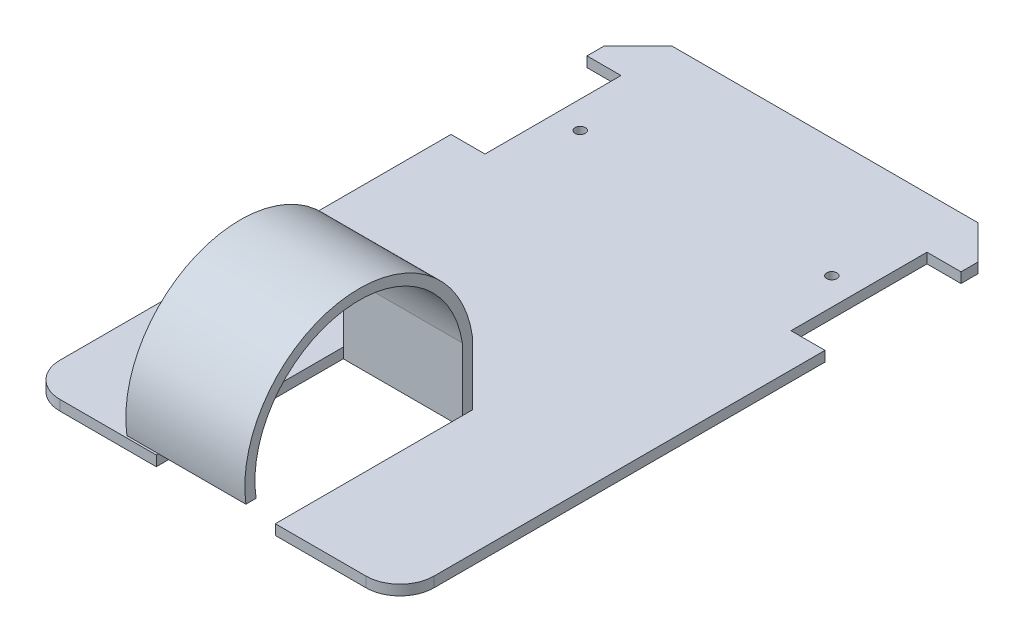
ISO-10303-21;
HEADER;
FILE_DESCRIPTION(('STEP AP214'),'2;1');
FILE_NAME('part.step','',(''),(''),'','','');
FILE_SCHEMA(('AUTOMOTIVE_DESIGN { 1 0 10303 214 1 1 1 1 }'));
ENDSEC;
DATA;
#1=APPLICATION_CONTEXT('core data for automotive mechanical design processes');
#2=APPLICATION_PROTOCOL_DEFINITION('international standard','automotive_design',2000,#1);
#3=PRODUCT_CONTEXT('',#1,'mechanical');
#4=PRODUCT('Part','Part','',(#3));
#5=PRODUCT_RELATED_PRODUCT_CATEGORY('part','',(#4));
#6=PRODUCT_DEFINITION_FORMATION('','',#4);
#7=PRODUCT_DEFINITION_CONTEXT('part definition',#1,'design');
#8=PRODUCT_DEFINITION('design','',#6,#7);
#9=PRODUCT_DEFINITION_SHAPE('','',#8);
#10=(LENGTH_UNIT() NAMED_UNIT(*) SI_UNIT(.MILLI.,.METRE.));
#11=(NAMED_UNIT(*) PLANE_ANGLE_UNIT() SI_UNIT($,.RADIAN.));
#12=(NAMED_UNIT(*) SI_UNIT($,.STERADIAN.) SOLID_ANGLE_UNIT());
#13=UNCERTAINTY_MEASURE_WITH_UNIT(LENGTH_MEASURE(1.E-05),#10,'distance_accuracy_value','');
#14=(GEOMETRIC_REPRESENTATION_CONTEXT(3) GLOBAL_UNCERTAINTY_ASSIGNED_CONTEXT((#13)) GLOBAL_UNIT_ASSIGNED_CONTEXT((#10,
#11,#12)) REPRESENTATION_CONTEXT('',''));
#15=CARTESIAN_POINT('',(0.,0.,0.));
#16=DIRECTION('',(0.,0.,1.));
#17=DIRECTION('',(1.,0.,0.));
#18=AXIS2_PLACEMENT_3D('',#15,#16,#17);
#19=CARTESIAN_POINT('',(55.,3.,90.));
#20=DIRECTION('',(-1.,0.,0.));
#21=DIRECTION('',(0.,0.,1.));
#22=AXIS2_PLACEMENT_3D('',#19,#20,#21);
#23=PLANE('',#22);
#24=DIRECTION('',(0.,0.,-1.));
#25=VECTOR('',#24,1.);
#26=CARTESIAN_POINT('',(55.,0.,90.));
#27=LINE('',#26,#25);
#28=CARTESIAN_POINT('',(55.,0.,80.));
#29=VERTEX_POINT('',#28);
#30=CARTESIAN_POINT('',(55.,0.,-35.));
#31=VERTEX_POINT('',#30);
#32=EDGE_CURVE('E222',#29,#31,#27,.T.);
#33=ORIENTED_EDGE('',*,*,#32,.T.);
#34=DIRECTION('',(0.,1.,0.));
#35=VECTOR('',#34,1.);
#36=CARTESIAN_POINT('',(55.,-0.00100000000000013,-35.));
#37=LINE('',#36,#35);
#38=CARTESIAN_POINT('',(55.,3.,-35.));
#39=VERTEX_POINT('',#38);
#40=EDGE_CURVE('E202',#31,#39,#37,.T.);
#41=ORIENTED_EDGE('',*,*,#40,.T.);
#42=DIRECTION('',(0.,0.,-1.));
#43=VECTOR('',#42,1.);
#44=CARTESIAN_POINT('',(55.,3.,90.));
#45=LINE('',#44,#43);
#46=CARTESIAN_POINT('',(55.,3.,80.));
#47=VERTEX_POINT('',#46);
#48=EDGE_CURVE('E452',#47,#39,#45,.T.);
#49=ORIENTED_EDGE('',*,*,#48,.F.);
#50=DIRECTION('',(0.,-1.,0.));
#51=VECTOR('',#50,1.);
#52=CARTESIAN_POINT('',(55.,3.,80.));
#53=LINE('',#52,#51);
#54=EDGE_CURVE('E230',#47,#29,#53,.T.);
#55=ORIENTED_EDGE('',*,*,#54,.T.);
#56=EDGE_LOOP('',(#33,#41,#49,#55));
#57=FACE_BOUND('',#56,.T.);
#58=ADVANCED_FACE('F34',(#57),#23,.F.);
#59=CARTESIAN_POINT('',(-55.,3.,90.));
#60=DIRECTION('',(1.,0.,0.));
#61=DIRECTION('',(0.,0.,-1.));
#62=AXIS2_PLACEMENT_3D('',#59,#60,#61);
#63=PLANE('',#62);
#64=DIRECTION('',(0.,0.,1.));
#65=VECTOR('',#64,1.);
#66=CARTESIAN_POINT('',(-55.,3.,90.));
#67=LINE('',#66,#65);
#68=CARTESIAN_POINT('',(-55.,3.,-79.9999999999999));
#69=VERTEX_POINT('',#68);
#70=CARTESIAN_POINT('',(-55.,3.,-75.));
#71=VERTEX_POINT('',#70);
#72=EDGE_CURVE('E314',#69,#71,#67,.T.);
#73=ORIENTED_EDGE('',*,*,#72,.F.);
#74=DIRECTION('',(0.,-1.,0.));
#75=VECTOR('',#74,1.);
#76=CARTESIAN_POINT('',(-55.,3.,-80.));
#77=LINE('',#76,#75);
#78=CARTESIAN_POINT('',(-55.,0.,-79.9999999999999));
#79=VERTEX_POINT('',#78);
#80=EDGE_CURVE('E265',#69,#79,#77,.T.);
#81=ORIENTED_EDGE('',*,*,#80,.T.);
#82=DIRECTION('',(0.,0.,1.));
#83=VECTOR('',#82,1.);
#84=CARTESIAN_POINT('',(-55.,0.,90.));
#85=LINE('',#84,#83);
#86=CARTESIAN_POINT('',(-55.,0.,-74.9999999999999));
#87=VERTEX_POINT('',#86);
#88=EDGE_CURVE('E241',#79,#87,#85,.T.);
#89=ORIENTED_EDGE('',*,*,#88,.T.);
#90=DIRECTION('',(0.,1.,0.));
#91=VECTOR('',#90,1.);
#92=CARTESIAN_POINT('',(-55.,-0.00100000000000013,-75.));
#93=LINE('',#92,#91);
#94=EDGE_CURVE('E323',#87,#71,#93,.T.);
#95=ORIENTED_EDGE('',*,*,#94,.T.);
#96=EDGE_LOOP('',(#73,#81,#89,#95));
#97=FACE_BOUND('',#96,.T.);
#98=ADVANCED_FACE('F321',(#97),#63,.F.);
#99=CARTESIAN_POINT('',(0.,3.,0.));
#100=DIRECTION('',(0.,-1.,0.));
#101=DIRECTION('',(0.,0.,-1.));
#102=AXIS2_PLACEMENT_3D('',#99,#100,#101);
#103=PLANE('',#102);
#104=CARTESIAN_POINT('',(-37.,3.,-55.));
#105=DIRECTION('',(0.,1.,0.));
#106=DIRECTION('',(0.,0.,1.));
#107=AXIS2_PLACEMENT_3D('',#104,#105,#106);
#108=CIRCLE('',#107,1.5);
#109=CARTESIAN_POINT('',(-37.,3.,-53.5));
#110=VERTEX_POINT('',#109);
#111=EDGE_CURVE('E424',#110,#110,#108,.T.);
#112=ORIENTED_EDGE('',*,*,#111,.F.);
#113=EDGE_LOOP('',(#112));
#114=FACE_BOUND('',#113,.T.);
#115=CARTESIAN_POINT('',(37.,3.,-55.));
#116=DIRECTION('',(0.,1.,0.));
#117=DIRECTION('',(0.,0.,1.));
#118=AXIS2_PLACEMENT_3D('',#115,#116,#117);
#119=CIRCLE('',#118,1.5);
#120=CARTESIAN_POINT('',(37.,3.,-53.5));
#121=VERTEX_POINT('',#120);
#122=EDGE_CURVE('E417',#121,#121,#119,.T.);
#123=ORIENTED_EDGE('',*,*,#122,.F.);
#124=EDGE_LOOP('',(#123));
#125=FACE_BOUND('',#124,.T.);
#126=DIRECTION('',(-1.,0.,0.));
#127=VECTOR('',#126,1.);
#128=CARTESIAN_POINT('',(-55.,3.,-90.));
#129=LINE('',#128,#127);
#130=CARTESIAN_POINT('',(45.,3.,-90.));
#131=VERTEX_POINT('',#130);
#132=CARTESIAN_POINT('',(-45.,3.,-90.));
#133=VERTEX_POINT('',#132);
#134=EDGE_CURVE('E316',#131,#133,#129,.T.);
#135=ORIENTED_EDGE('',*,*,#134,.T.);
#136=DIRECTION('',(0.70710678118655,0.,-0.707106781186546));
#137=VECTOR('',#136,1.);
#138=CARTESIAN_POINT('',(-55.,3.,-80.));
#139=LINE('',#138,#137);
#140=EDGE_CURVE('E42',#133,#69,#139,.F.);
#141=ORIENTED_EDGE('',*,*,#140,.T.);
#142=ORIENTED_EDGE('',*,*,#72,.T.);
#143=DIRECTION('',(-1.,0.,0.));
#144=VECTOR('',#143,1.);
#145=CARTESIAN_POINT('',(-55.,3.,-75.));
#146=LINE('',#145,#144);
#147=CARTESIAN_POINT('',(-45.,3.,-75.));
#148=VERTEX_POINT('',#147);
#149=EDGE_CURVE('E360',#148,#71,#146,.T.);
#150=ORIENTED_EDGE('',*,*,#149,.F.);
#151=DIRECTION('',(0.,0.,-1.));
#152=VECTOR('',#151,1.);
#153=CARTESIAN_POINT('',(-45.,3.,-75.));
#154=LINE('',#153,#152);
#155=CARTESIAN_POINT('',(-45.,3.,-35.));
#156=VERTEX_POINT('',#155);
#157=EDGE_CURVE('E357',#156,#148,#154,.T.);
#158=ORIENTED_EDGE('',*,*,#157,.F.);
#159=DIRECTION('',(1.,0.,0.));
#160=VECTOR('',#159,1.);
#161=CARTESIAN_POINT('',(-45.,3.,-35.));
#162=LINE('',#161,#160);
#163=CARTESIAN_POINT('',(-55.,3.,-35.));
#164=VERTEX_POINT('',#163);
#165=EDGE_CURVE('E354',#164,#156,#162,.T.);
#166=ORIENTED_EDGE('',*,*,#165,.F.);
#167=CARTESIAN_POINT('',(-55.,3.,80.));
#168=VERTEX_POINT('',#167);
#169=EDGE_CURVE('E325',#164,#168,#67,.T.);
#170=ORIENTED_EDGE('',*,*,#169,.T.);
#171=CARTESIAN_POINT('',(-45.,3.,80.));
#172=DIRECTION('',(0.,-1.,0.));
#173=DIRECTION('',(0.,0.,-1.));
#174=AXIS2_PLACEMENT_3D('',#171,#172,#173);
#175=CIRCLE('',#174,10.);
#176=CARTESIAN_POINT('',(-45.,3.,90.));
#177=VERTEX_POINT('',#176);
#178=EDGE_CURVE('E256',#168,#177,#175,.F.);
#179=ORIENTED_EDGE('',*,*,#178,.T.);
#180=DIRECTION('',(1.,0.,0.));
#181=VECTOR('',#180,1.);
#182=CARTESIAN_POINT('',(-55.,3.,90.));
#183=LINE('',#182,#181);
#184=CARTESIAN_POINT('',(-16.6764380170673,3.,90.));
#185=VERTEX_POINT('',#184);
#186=EDGE_CURVE('E238',#177,#185,#183,.T.);
#187=ORIENTED_EDGE('',*,*,#186,.T.);
#188=DIRECTION('',(0.,0.,1.));
#189=VECTOR('',#188,1.);
#190=CARTESIAN_POINT('',(-16.6764380170673,3.,35.));
#191=LINE('',#190,#189);
#192=CARTESIAN_POINT('',(-16.6764380170673,3.,35.));
#193=VERTEX_POINT('',#192);
#194=EDGE_CURVE('E437',#193,#185,#191,.T.);
#195=ORIENTED_EDGE('',*,*,#194,.F.);
#196=DIRECTION('',(0.,0.,1.));
#197=VECTOR('',#196,1.);
#198=CARTESIAN_POINT('',(-16.6764380170673,3.,35.));
#199=LINE('',#198,#197);
#200=CARTESIAN_POINT('',(-16.6764380170673,3.,32.));
#201=VERTEX_POINT('',#200);
#202=EDGE_CURVE('E285',#201,#193,#199,.T.);
#203=ORIENTED_EDGE('',*,*,#202,.F.);
#204=DIRECTION('',(-1.,0.,0.));
#205=VECTOR('',#204,1.);
#206=CARTESIAN_POINT('',(18.3235619829327,3.,32.));
#207=LINE('',#206,#205);
#208=CARTESIAN_POINT('',(18.3235619829327,3.,32.));
#209=VERTEX_POINT('',#208);
#210=EDGE_CURVE('E412',#209,#201,#207,.T.);
#211=ORIENTED_EDGE('',*,*,#210,.F.);
#212=DIRECTION('',(0.,0.,-1.));
#213=VECTOR('',#212,1.);
#214=CARTESIAN_POINT('',(18.3235619829327,3.,35.));
#215=LINE('',#214,#213);
#216=CARTESIAN_POINT('',(18.3235619829327,3.,35.));
#217=VERTEX_POINT('',#216);
#218=EDGE_CURVE('E375',#217,#209,#215,.T.);
#219=ORIENTED_EDGE('',*,*,#218,.F.);
#220=DIRECTION('',(0.,0.,-1.));
#221=VECTOR('',#220,1.);
#222=CARTESIAN_POINT('',(18.3235619829327,3.,35.));
#223=LINE('',#222,#221);
#224=CARTESIAN_POINT('',(18.3235619829327,3.,90.));
#225=VERTEX_POINT('',#224);
#226=EDGE_CURVE('E440',#225,#217,#223,.T.);
#227=ORIENTED_EDGE('',*,*,#226,.F.);
#228=CARTESIAN_POINT('',(45.,3.,90.));
#229=VERTEX_POINT('',#228);
#230=EDGE_CURVE('E324',#225,#229,#183,.T.);
#231=ORIENTED_EDGE('',*,*,#230,.T.);
#232=CARTESIAN_POINT('',(45.,3.,80.));
#233=DIRECTION('',(0.,-1.,0.));
#234=DIRECTION('',(0.,0.,-1.));
#235=AXIS2_PLACEMENT_3D('',#232,#233,#234);
#236=CIRCLE('',#235,10.);
#237=EDGE_CURVE('E263',#229,#47,#236,.F.);
#238=ORIENTED_EDGE('',*,*,#237,.T.);
#239=ORIENTED_EDGE('',*,*,#48,.T.);
#240=DIRECTION('',(1.,0.,0.));
#241=VECTOR('',#240,1.);
#242=CARTESIAN_POINT('',(45.,3.,-35.));
#243=LINE('',#242,#241);
#244=CARTESIAN_POINT('',(45.,3.,-35.));
#245=VERTEX_POINT('',#244);
#246=EDGE_CURVE('E208',#245,#39,#243,.T.);
#247=ORIENTED_EDGE('',*,*,#246,.F.);
#248=DIRECTION('',(0.,0.,1.));
#249=VECTOR('',#248,1.);
#250=CARTESIAN_POINT('',(45.,3.,-75.));
#251=LINE('',#250,#249);
#252=CARTESIAN_POINT('',(45.,3.,-75.));
#253=VERTEX_POINT('',#252);
#254=EDGE_CURVE('E343',#253,#245,#251,.T.);
#255=ORIENTED_EDGE('',*,*,#254,.F.);
#256=DIRECTION('',(-1.,0.,0.));
#257=VECTOR('',#256,1.);
#258=CARTESIAN_POINT('',(55.,3.,-75.));
#259=LINE('',#258,#257);
#260=CARTESIAN_POINT('',(55.,3.,-75.));
#261=VERTEX_POINT('',#260);
#262=EDGE_CURVE('E226',#261,#253,#259,.T.);
#263=ORIENTED_EDGE('',*,*,#262,.F.);
#264=CARTESIAN_POINT('',(55.,3.,-79.9999999999999));
#265=VERTEX_POINT('',#264);
#266=EDGE_CURVE('E246',#261,#265,#45,.T.);
#267=ORIENTED_EDGE('',*,*,#266,.T.);
#268=DIRECTION('',(0.707106781186547,0.,0.707106781186549));
#269=VECTOR('',#268,1.);
#270=CARTESIAN_POINT('',(45.,3.,-90.));
#271=LINE('',#270,#269);
#272=EDGE_CURVE('E308',#265,#131,#271,.F.);
#273=ORIENTED_EDGE('',*,*,#272,.T.);
#274=EDGE_LOOP('',(#135,#141,#142,#150,#158,#166,#170,#179,#187,#195,#203,#211,#219,#227,#231,
#238,#239,#247,#255,#263,#267,#273));
#275=FACE_BOUND('',#274,.T.);
#276=ADVANCED_FACE('F312',(#114,#125,#275),#103,.F.);
#277=CARTESIAN_POINT('',(-55.,3.,90.));
#278=DIRECTION('',(0.,0.,-1.));
#279=DIRECTION('',(-1.,0.,0.));
#280=AXIS2_PLACEMENT_3D('',#277,#278,#279);
#281=PLANE('',#280);
#282=ORIENTED_EDGE('',*,*,#186,.F.);
#283=DIRECTION('',(0.,-1.,0.));
#284=VECTOR('',#283,1.);
#285=CARTESIAN_POINT('',(-45.,3.,90.));
#286=LINE('',#285,#284);
#287=CARTESIAN_POINT('',(-45.,0.,90.));
#288=VERTEX_POINT('',#287);
#289=EDGE_CURVE('E247',#177,#288,#286,.T.);
#290=ORIENTED_EDGE('',*,*,#289,.T.);
#291=DIRECTION('',(1.,0.,0.));
#292=VECTOR('',#291,1.);
#293=CARTESIAN_POINT('',(-55.,0.,90.));
#294=LINE('',#293,#292);
#295=CARTESIAN_POINT('',(-16.6764380170673,0.,90.));
#296=VERTEX_POINT('',#295);
#297=EDGE_CURVE('E244',#288,#296,#294,.T.);
#298=ORIENTED_EDGE('',*,*,#297,.T.);
#299=DIRECTION('',(0.,1.,0.));
#300=VECTOR('',#299,1.);
#301=CARTESIAN_POINT('',(-16.6764380170673,-0.00100000000000013,90.));
#302=LINE('',#301,#300);
#303=EDGE_CURVE('E443',#296,#185,#302,.T.);
#304=ORIENTED_EDGE('',*,*,#303,.T.);
#305=EDGE_LOOP('',(#282,#290,#298,#304));
#306=FACE_BOUND('',#305,.T.);
#307=ADVANCED_FACE('F469',(#306),#281,.F.);
#308=CARTESIAN_POINT('',(55.,0.,-74.9999999999999));
#309=VERTEX_POINT('',#308);
#310=CARTESIAN_POINT('',(55.,0.,-79.9999999999999));
#311=VERTEX_POINT('',#310);
#312=EDGE_CURVE('E232',#309,#311,#27,.T.);
#313=ORIENTED_EDGE('',*,*,#312,.T.);
#314=DIRECTION('',(0.,1.,0.));
#315=VECTOR('',#314,1.);
#316=CARTESIAN_POINT('',(55.,3.,-80.));
#317=LINE('',#316,#315);
#318=EDGE_CURVE('E12',#311,#265,#317,.T.);
#319=ORIENTED_EDGE('',*,*,#318,.T.);
#320=ORIENTED_EDGE('',*,*,#266,.F.);
#321=DIRECTION('',(0.,1.,0.));
#322=VECTOR('',#321,1.);
#323=CARTESIAN_POINT('',(55.,-0.00100000000000013,-75.));
#324=LINE('',#323,#322);
#325=EDGE_CURVE('E336',#309,#261,#324,.T.);
#326=ORIENTED_EDGE('',*,*,#325,.F.);
#327=EDGE_LOOP('',(#313,#319,#320,#326));
#328=FACE_BOUND('',#327,.T.);
#329=ADVANCED_FACE('F335',(#328),#23,.F.);
#330=CARTESIAN_POINT('',(-55.,3.,-90.));
#331=DIRECTION('',(0.,0.,1.));
#332=DIRECTION('',(1.,0.,0.));
#333=AXIS2_PLACEMENT_3D('',#330,#331,#332);
#334=PLANE('',#333);
#335=DIRECTION('',(-1.,0.,0.));
#336=VECTOR('',#335,1.);
#337=CARTESIAN_POINT('',(-55.,0.,-90.));
#338=LINE('',#337,#336);
#339=CARTESIAN_POINT('',(45.,0.,-90.));
#340=VERTEX_POINT('',#339);
#341=CARTESIAN_POINT('',(-45.,0.,-90.));
#342=VERTEX_POINT('',#341);
#343=EDGE_CURVE('E231',#340,#342,#338,.T.);
#344=ORIENTED_EDGE('',*,*,#343,.T.);
#345=DIRECTION('',(0.,1.,0.));
#346=VECTOR('',#345,1.);
#347=CARTESIAN_POINT('',(-45.,3.,-90.));
#348=LINE('',#347,#346);
#349=EDGE_CURVE('E55',#342,#133,#348,.T.);
#350=ORIENTED_EDGE('',*,*,#349,.T.);
#351=ORIENTED_EDGE('',*,*,#134,.F.);
#352=DIRECTION('',(0.,-1.,0.));
#353=VECTOR('',#352,1.);
#354=CARTESIAN_POINT('',(45.,3.,-90.));
#355=LINE('',#354,#353);
#356=EDGE_CURVE('E304',#131,#340,#355,.T.);
#357=ORIENTED_EDGE('',*,*,#356,.T.);
#358=EDGE_LOOP('',(#344,#350,#351,#357));
#359=FACE_BOUND('',#358,.T.);
#360=ADVANCED_FACE('F329',(#359),#334,.F.);
#361=ORIENTED_EDGE('',*,*,#169,.F.);
#362=DIRECTION('',(0.,1.,0.));
#363=VECTOR('',#362,1.);
#364=CARTESIAN_POINT('',(-55.,-0.00100000000000013,-35.));
#365=LINE('',#364,#363);
#366=CARTESIAN_POINT('',(-55.,0.,-35.));
#367=VERTEX_POINT('',#366);
#368=EDGE_CURVE('E362',#367,#164,#365,.T.);
#369=ORIENTED_EDGE('',*,*,#368,.F.);
#370=CARTESIAN_POINT('',(-55.,0.,80.));
#371=VERTEX_POINT('',#370);
#372=EDGE_CURVE('E234',#367,#371,#85,.T.);
#373=ORIENTED_EDGE('',*,*,#372,.T.);
#374=DIRECTION('',(0.,-1.,0.));
#375=VECTOR('',#374,1.);
#376=CARTESIAN_POINT('',(-55.,3.,80.));
#377=LINE('',#376,#375);
#378=EDGE_CURVE('E253',#371,#168,#377,.F.);
#379=ORIENTED_EDGE('',*,*,#378,.T.);
#380=EDGE_LOOP('',(#361,#369,#373,#379));
#381=FACE_BOUND('',#380,.T.);
#382=ADVANCED_FACE('F462',(#381),#63,.F.);
#383=CARTESIAN_POINT('',(18.3235619829327,0.,90.));
#384=VERTEX_POINT('',#383);
#385=CARTESIAN_POINT('',(45.,0.,90.));
#386=VERTEX_POINT('',#385);
#387=EDGE_CURVE('E243',#384,#386,#294,.T.);
#388=ORIENTED_EDGE('',*,*,#387,.T.);
#389=DIRECTION('',(0.,-1.,0.));
#390=VECTOR('',#389,1.);
#391=CARTESIAN_POINT('',(45.,3.,90.));
#392=LINE('',#391,#390);
#393=EDGE_CURVE('E261',#386,#229,#392,.F.);
#394=ORIENTED_EDGE('',*,*,#393,.T.);
#395=ORIENTED_EDGE('',*,*,#230,.F.);
#396=DIRECTION('',(0.,1.,0.));
#397=VECTOR('',#396,1.);
#398=CARTESIAN_POINT('',(18.3235619829327,-0.00100000000000013,90.));
#399=LINE('',#398,#397);
#400=EDGE_CURVE('E448',#384,#225,#399,.T.);
#401=ORIENTED_EDGE('',*,*,#400,.F.);
#402=EDGE_LOOP('',(#388,#394,#395,#401));
#403=FACE_BOUND('',#402,.T.);
#404=ADVANCED_FACE('F497',(#403),#281,.F.);
#405=CARTESIAN_POINT('',(0.,0.,0.));
#406=DIRECTION('',(0.,-1.,0.));
#407=DIRECTION('',(0.,0.,-1.));
#408=AXIS2_PLACEMENT_3D('',#405,#406,#407);
#409=PLANE('',#408);
#410=ORIENTED_EDGE('',*,*,#88,.F.);
#411=DIRECTION('',(-0.70710678118655,0.,0.707106781186546));
#412=VECTOR('',#411,1.);
#413=CARTESIAN_POINT('',(-67.4999999999999,0.,-67.5000000000002));
#414=LINE('',#413,#412);
#415=EDGE_CURVE('E302',#79,#342,#414,.F.);
#416=ORIENTED_EDGE('',*,*,#415,.T.);
#417=ORIENTED_EDGE('',*,*,#343,.F.);
#418=DIRECTION('',(-0.707106781186547,0.,-0.707106781186549));
#419=VECTOR('',#418,1.);
#420=CARTESIAN_POINT('',(67.5000000000001,0.,-67.4999999999999));
#421=LINE('',#420,#419);
#422=EDGE_CURVE('E300',#340,#311,#421,.F.);
#423=ORIENTED_EDGE('',*,*,#422,.T.);
#424=ORIENTED_EDGE('',*,*,#312,.F.);
#425=DIRECTION('',(-1.,0.,0.));
#426=VECTOR('',#425,1.);
#427=CARTESIAN_POINT('',(55.,0.,-75.));
#428=LINE('',#427,#426);
#429=CARTESIAN_POINT('',(45.,0.,-75.));
#430=VERTEX_POINT('',#429);
#431=EDGE_CURVE('E213',#309,#430,#428,.T.);
#432=ORIENTED_EDGE('',*,*,#431,.T.);
#433=DIRECTION('',(0.,0.,1.));
#434=VECTOR('',#433,1.);
#435=CARTESIAN_POINT('',(45.,0.,-75.));
#436=LINE('',#435,#434);
#437=CARTESIAN_POINT('',(45.,0.,-35.));
#438=VERTEX_POINT('',#437);
#439=EDGE_CURVE('E225',#430,#438,#436,.T.);
#440=ORIENTED_EDGE('',*,*,#439,.T.);
#441=DIRECTION('',(1.,0.,0.));
#442=VECTOR('',#441,1.);
#443=CARTESIAN_POINT('',(45.,0.,-35.));
#444=LINE('',#443,#442);
#445=EDGE_CURVE('E205',#438,#31,#444,.T.);
#446=ORIENTED_EDGE('',*,*,#445,.T.);
#447=ORIENTED_EDGE('',*,*,#32,.F.);
#448=CARTESIAN_POINT('',(45.,0.,80.));
#449=DIRECTION('',(0.,-1.,0.));
#450=DIRECTION('',(0.,0.,-1.));
#451=AXIS2_PLACEMENT_3D('',#448,#449,#450);
#452=CIRCLE('',#451,10.);
#453=EDGE_CURVE('E259',#29,#386,#452,.T.);
#454=ORIENTED_EDGE('',*,*,#453,.T.);
#455=ORIENTED_EDGE('',*,*,#387,.F.);
#456=DIRECTION('',(0.,0.,-1.));
#457=VECTOR('',#456,1.);
#458=CARTESIAN_POINT('',(18.3235619829327,0.,35.));
#459=LINE('',#458,#457);
#460=CARTESIAN_POINT('',(18.3235619829327,0.,35.));
#461=VERTEX_POINT('',#460);
#462=EDGE_CURVE('E420',#384,#461,#459,.T.);
#463=ORIENTED_EDGE('',*,*,#462,.T.);
#464=DIRECTION('',(-1.,0.,0.));
#465=VECTOR('',#464,1.);
#466=CARTESIAN_POINT('',(-16.6764380170673,0.,35.));
#467=LINE('',#466,#465);
#468=CARTESIAN_POINT('',(-16.6764380170673,0.,35.));
#469=VERTEX_POINT('',#468);
#470=EDGE_CURVE('E431',#461,#469,#467,.T.);
#471=ORIENTED_EDGE('',*,*,#470,.T.);
#472=DIRECTION('',(0.,0.,1.));
#473=VECTOR('',#472,1.);
#474=CARTESIAN_POINT('',(-16.6764380170673,0.,35.));
#475=LINE('',#474,#473);
#476=EDGE_CURVE('E434',#469,#296,#475,.T.);
#477=ORIENTED_EDGE('',*,*,#476,.T.);
#478=ORIENTED_EDGE('',*,*,#297,.F.);
#479=CARTESIAN_POINT('',(-45.,0.,80.));
#480=DIRECTION('',(0.,-1.,0.));
#481=DIRECTION('',(0.,0.,-1.));
#482=AXIS2_PLACEMENT_3D('',#479,#480,#481);
#483=CIRCLE('',#482,10.);
#484=EDGE_CURVE('E250',#288,#371,#483,.T.);
#485=ORIENTED_EDGE('',*,*,#484,.T.);
#486=ORIENTED_EDGE('',*,*,#372,.F.);
#487=DIRECTION('',(1.,0.,0.));
#488=VECTOR('',#487,1.);
#489=CARTESIAN_POINT('',(-45.,0.,-35.));
#490=LINE('',#489,#488);
#491=CARTESIAN_POINT('',(-45.,0.,-35.));
#492=VERTEX_POINT('',#491);
#493=EDGE_CURVE('E364',#367,#492,#490,.T.);
#494=ORIENTED_EDGE('',*,*,#493,.T.);
#495=DIRECTION('',(0.,0.,-1.));
#496=VECTOR('',#495,1.);
#497=CARTESIAN_POINT('',(-45.,0.,-75.));
#498=LINE('',#497,#496);
#499=CARTESIAN_POINT('',(-45.,0.,-75.));
#500=VERTEX_POINT('',#499);
#501=EDGE_CURVE('E349',#492,#500,#498,.T.);
#502=ORIENTED_EDGE('',*,*,#501,.T.);
#503=DIRECTION('',(-1.,0.,0.));
#504=VECTOR('',#503,1.);
#505=CARTESIAN_POINT('',(-55.,0.,-75.));
#506=LINE('',#505,#504);
#507=EDGE_CURVE('E352',#500,#87,#506,.T.);
#508=ORIENTED_EDGE('',*,*,#507,.T.);
#509=EDGE_LOOP('',(#410,#416,#417,#423,#424,#432,#440,#446,#447,#454,#455,#463,#471,#477,#478,
#485,#486,#494,#502,#508));
#510=FACE_BOUND('',#509,.T.);
#511=CARTESIAN_POINT('',(37.,0.,-55.));
#512=DIRECTION('',(0.,-1.,0.));
#513=DIRECTION('',(0.,0.,-1.));
#514=AXIS2_PLACEMENT_3D('',#511,#512,#513);
#515=CIRCLE('',#514,1.5);
#516=CARTESIAN_POINT('',(37.,0.,-53.5));
#517=VERTEX_POINT('',#516);
#518=EDGE_CURVE('E421',#517,#517,#515,.F.);
#519=ORIENTED_EDGE('',*,*,#518,.T.);
#520=EDGE_LOOP('',(#519));
#521=FACE_BOUND('',#520,.T.);
#522=CARTESIAN_POINT('',(-37.,0.,-55.));
#523=DIRECTION('',(0.,-1.,0.));
#524=DIRECTION('',(0.,0.,-1.));
#525=AXIS2_PLACEMENT_3D('',#522,#523,#524);
#526=CIRCLE('',#525,1.5);
#527=CARTESIAN_POINT('',(-37.,0.,-53.5));
#528=VERTEX_POINT('',#527);
#529=EDGE_CURVE('E295',#528,#528,#526,.F.);
#530=ORIENTED_EDGE('',*,*,#529,.T.);
#531=EDGE_LOOP('',(#530));
#532=FACE_BOUND('',#531,.T.);
#533=ADVANCED_FACE('F220',(#510,#521,#532),#409,.T.);
#534=CARTESIAN_POINT('',(-16.6764380170673,-0.00100000000000013,35.));
#535=DIRECTION('',(-1.,0.,0.));
#536=DIRECTION('',(0.,0.,1.));
#537=AXIS2_PLACEMENT_3D('',#534,#535,#536);
#538=PLANE('',#537);
#539=DIRECTION('',(0.,1.,0.));
#540=VECTOR('',#539,1.);
#541=CARTESIAN_POINT('',(-16.6764380170673,-0.00100000000000013,35.));
#542=LINE('',#541,#540);
#543=EDGE_CURVE('E236',#469,#193,#542,.T.);
#544=ORIENTED_EDGE('',*,*,#543,.T.);
#545=ORIENTED_EDGE('',*,*,#194,.T.);
#546=ORIENTED_EDGE('',*,*,#303,.F.);
#547=ORIENTED_EDGE('',*,*,#476,.F.);
#548=EDGE_LOOP('',(#544,#545,#546,#547));
#549=FACE_BOUND('',#548,.T.);
#550=ADVANCED_FACE('F474',(#549),#538,.F.);
#551=CARTESIAN_POINT('',(-16.6764380170673,-0.00100000000000013,35.));
#552=DIRECTION('',(0.,0.,-1.));
#553=DIRECTION('',(-1.,0.,0.));
#554=AXIS2_PLACEMENT_3D('',#551,#552,#553);
#555=PLANE('',#554);
#556=DIRECTION('',(0.,1.,0.));
#557=VECTOR('',#556,1.);
#558=CARTESIAN_POINT('',(18.3235619829327,-0.00100000000000013,35.));
#559=LINE('',#558,#557);
#560=EDGE_CURVE('E445',#461,#217,#559,.T.);
#561=ORIENTED_EDGE('',*,*,#560,.T.);
#562=DIRECTION('',(0.,-1.,0.));
#563=VECTOR('',#562,1.);
#564=CARTESIAN_POINT('',(18.3235619829327,21.556787546894,35.));
#565=LINE('',#564,#563);
#566=CARTESIAN_POINT('',(18.3235619829327,21.556787546894,35.));
#567=VERTEX_POINT('',#566);
#568=EDGE_CURVE('E266',#567,#217,#565,.T.);
#569=ORIENTED_EDGE('',*,*,#568,.F.);
#570=DIRECTION('',(1.,0.,0.));
#571=VECTOR('',#570,1.);
#572=CARTESIAN_POINT('',(18.3235619829327,21.556787546894,35.));
#573=LINE('',#572,#571);
#574=CARTESIAN_POINT('',(-16.6764380170673,21.556787546894,35.));
#575=VERTEX_POINT('',#574);
#576=EDGE_CURVE('E270',#575,#567,#573,.T.);
#577=ORIENTED_EDGE('',*,*,#576,.F.);
#578=DIRECTION('',(0.,-1.,0.));
#579=VECTOR('',#578,1.);
#580=CARTESIAN_POINT('',(-16.6764380170673,21.556787546894,35.));
#581=LINE('',#580,#579);
#582=EDGE_CURVE('E269',#575,#193,#581,.T.);
#583=ORIENTED_EDGE('',*,*,#582,.T.);
#584=ORIENTED_EDGE('',*,*,#543,.F.);
#585=ORIENTED_EDGE('',*,*,#470,.F.);
#586=EDGE_LOOP('',(#561,#569,#577,#583,#584,#585));
#587=FACE_BOUND('',#586,.T.);
#588=ADVANCED_FACE('F477',(#587),#555,.F.);
#589=CARTESIAN_POINT('',(18.3235619829327,-0.00100000000000013,35.));
#590=DIRECTION('',(1.,0.,0.));
#591=DIRECTION('',(0.,0.,-1.));
#592=AXIS2_PLACEMENT_3D('',#589,#590,#591);
#593=PLANE('',#592);
#594=ORIENTED_EDGE('',*,*,#400,.T.);
#595=ORIENTED_EDGE('',*,*,#226,.T.);
#596=ORIENTED_EDGE('',*,*,#560,.F.);
#597=ORIENTED_EDGE('',*,*,#462,.F.);
#598=EDGE_LOOP('',(#594,#595,#596,#597));
#599=FACE_BOUND('',#598,.T.);
#600=ADVANCED_FACE('F492',(#599),#593,.F.);
#601=CARTESIAN_POINT('',(-37.,-0.00100000000000013,-55.));
#602=DIRECTION('',(0.,1.,0.));
#603=DIRECTION('',(0.,0.,1.));
#604=AXIS2_PLACEMENT_3D('',#601,#602,#603);
#605=CYLINDRICAL_SURFACE('',#604,1.5);
#606=CARTESIAN_POINT('',(-37.,0.,-53.5));
#607=CARTESIAN_POINT('',(-37.,0.03125,-53.5));
#608=CARTESIAN_POINT('',(-37.,0.0625,-53.5));
#609=CARTESIAN_POINT('',(-37.,0.125,-53.5));
#610=CARTESIAN_POINT('',(-37.,0.15625,-53.5));
#611=CARTESIAN_POINT('',(-37.,0.21875,-53.5));
#612=CARTESIAN_POINT('',(-37.,0.25,-53.5));
#613=CARTESIAN_POINT('',(-37.,0.3125,-53.5));
#614=CARTESIAN_POINT('',(-37.,0.34375,-53.5));
#615=CARTESIAN_POINT('',(-37.,0.40625,-53.5));
#616=CARTESIAN_POINT('',(-37.,0.4375,-53.5));
#617=CARTESIAN_POINT('',(-37.,0.5,-53.5));
#618=CARTESIAN_POINT('',(-37.,0.53125,-53.5));
#619=CARTESIAN_POINT('',(-37.,0.59375,-53.5));
#620=CARTESIAN_POINT('',(-37.,0.625,-53.5));
#621=CARTESIAN_POINT('',(-37.,0.6875,-53.5));
#622=CARTESIAN_POINT('',(-37.,0.71875,-53.5));
#623=CARTESIAN_POINT('',(-37.,0.78125,-53.5));
#624=CARTESIAN_POINT('',(-37.,0.8125,-53.5));
#625=CARTESIAN_POINT('',(-37.,0.875,-53.5));
#626=CARTESIAN_POINT('',(-37.,0.90625,-53.5));
#627=CARTESIAN_POINT('',(-37.,0.96875,-53.5));
#628=CARTESIAN_POINT('',(-37.,1.,-53.5));
#629=CARTESIAN_POINT('',(-37.,1.0625,-53.5));
#630=CARTESIAN_POINT('',(-37.,1.09375,-53.5));
#631=CARTESIAN_POINT('',(-37.,1.15625,-53.5));
#632=CARTESIAN_POINT('',(-37.,1.1875,-53.5));
#633=CARTESIAN_POINT('',(-37.,1.25,-53.5));
#634=CARTESIAN_POINT('',(-37.,1.28125,-53.5));
#635=CARTESIAN_POINT('',(-37.,1.34375,-53.5));
#636=CARTESIAN_POINT('',(-37.,1.375,-53.5));
#637=CARTESIAN_POINT('',(-37.,1.4375,-53.5));
#638=CARTESIAN_POINT('',(-37.,1.46875,-53.5));
#639=CARTESIAN_POINT('',(-37.,1.53125,-53.5));
#640=CARTESIAN_POINT('',(-37.,1.5625,-53.5));
#641=CARTESIAN_POINT('',(-37.,1.625,-53.5));
#642=CARTESIAN_POINT('',(-37.,1.65625,-53.5));
#643=CARTESIAN_POINT('',(-37.,1.71875,-53.5));
#644=CARTESIAN_POINT('',(-37.,1.75,-53.5));
#645=CARTESIAN_POINT('',(-37.,1.8125,-53.5));
#646=CARTESIAN_POINT('',(-37.,1.84375,-53.5));
#647=CARTESIAN_POINT('',(-37.,1.90625,-53.5));
#648=CARTESIAN_POINT('',(-37.,1.9375,-53.5));
#649=CARTESIAN_POINT('',(-37.,2.,-53.5));
#650=CARTESIAN_POINT('',(-37.,2.03125,-53.5));
#651=CARTESIAN_POINT('',(-37.,2.09375,-53.5));
#652=CARTESIAN_POINT('',(-37.,2.125,-53.5));
#653=CARTESIAN_POINT('',(-37.,2.1875,-53.5));
#654=CARTESIAN_POINT('',(-37.,2.21875,-53.5));
#655=CARTESIAN_POINT('',(-37.,2.28125,-53.5));
#656=CARTESIAN_POINT('',(-37.,2.3125,-53.5));
#657=CARTESIAN_POINT('',(-37.,2.375,-53.5));
#658=CARTESIAN_POINT('',(-37.,2.40625,-53.5));
#659=CARTESIAN_POINT('',(-37.,2.46875,-53.5));
#660=CARTESIAN_POINT('',(-37.,2.5,-53.5));
#661=CARTESIAN_POINT('',(-37.,2.5625,-53.5));
#662=CARTESIAN_POINT('',(-37.,2.59375,-53.5));
#663=CARTESIAN_POINT('',(-37.,2.65625,-53.5));
#664=CARTESIAN_POINT('',(-37.,2.6875,-53.5));
#665=CARTESIAN_POINT('',(-37.,2.75,-53.5));
#666=CARTESIAN_POINT('',(-37.,2.78125,-53.5));
#667=CARTESIAN_POINT('',(-37.,2.84375,-53.5));
#668=CARTESIAN_POINT('',(-37.,2.875,-53.5));
#669=CARTESIAN_POINT('',(-37.,2.9375,-53.5));
#670=CARTESIAN_POINT('',(-37.,2.96875,-53.5));
#671=CARTESIAN_POINT('',(-37.,3.,-53.5));
#672=B_SPLINE_CURVE_WITH_KNOTS('',3,(#606,#607,#608,#609,#610,#611,#612,#613,#614,#615,#616,
#617,#618,#619,#620,#621,#622,#623,#624,#625,#626,#627,#628,#629,#630,#631,#632,#633,#634,#635,
#636,#637,#638,#639,#640,#641,#642,#643,#644,#645,#646,#647,#648,#649,#650,#651,#652,#653,#654,
#655,#656,#657,#658,#659,#660,#661,#662,#663,#664,#665,#666,#667,#668,#669,#670,#671),
.UNSPECIFIED.,.F.,.F.,(4,2,2,2,2,2,2,2,2,2,2,2,2,2,2,2,2,2,2,2,2,2,2,2,2,2,2,2,2,2,2,2,4),(0.,
0.09375,0.1875,0.28125,0.375,0.46875,0.5625,0.65625,0.75,0.84375,0.9375,1.03125,1.125,1.21875,
1.3125,1.40625,1.5,1.59375,1.6875,1.78125,1.875,1.96875,2.0625,2.15625,2.25,2.34375,2.4375,
2.53125,2.625,2.71875,2.8125,2.90625,3.),.UNSPECIFIED.);
#673=EDGE_CURVE('BSEAM704',#528,#110,#672,.T.);
#674=ORIENTED_EDGE('',*,*,#529,.F.);
#675=ORIENTED_EDGE('',*,*,#111,.T.);
#676=ORIENTED_EDGE('',*,*,#673,.T.);
#677=ORIENTED_EDGE('',*,*,#673,.F.);
#678=EDGE_LOOP('',(#674,#676,#675,#677));
#679=FACE_BOUND('',#678,.T.);
#680=ADVANCED_FACE('F704',(#679),#605,.F.);
#681=CARTESIAN_POINT('',(37.,-0.00100000000000013,-55.));
#682=DIRECTION('',(0.,1.,0.));
#683=DIRECTION('',(0.,0.,1.));
#684=AXIS2_PLACEMENT_3D('',#681,#682,#683);
#685=CYLINDRICAL_SURFACE('',#684,1.5);
#686=CARTESIAN_POINT('',(37.,0.,-53.5));
#687=CARTESIAN_POINT('',(37.,0.03125,-53.5));
#688=CARTESIAN_POINT('',(37.,0.0625,-53.5));
#689=CARTESIAN_POINT('',(37.,0.125,-53.5));
#690=CARTESIAN_POINT('',(37.,0.15625,-53.5));
#691=CARTESIAN_POINT('',(37.,0.21875,-53.5));
#692=CARTESIAN_POINT('',(37.,0.25,-53.5));
#693=CARTESIAN_POINT('',(37.,0.3125,-53.5));
#694=CARTESIAN_POINT('',(37.,0.34375,-53.5));
#695=CARTESIAN_POINT('',(37.,0.40625,-53.5));
#696=CARTESIAN_POINT('',(37.,0.4375,-53.5));
#697=CARTESIAN_POINT('',(37.,0.5,-53.5));
#698=CARTESIAN_POINT('',(37.,0.53125,-53.5));
#699=CARTESIAN_POINT('',(37.,0.59375,-53.5));
#700=CARTESIAN_POINT('',(37.,0.625,-53.5));
#701=CARTESIAN_POINT('',(37.,0.6875,-53.5));
#702=CARTESIAN_POINT('',(37.,0.71875,-53.5));
#703=CARTESIAN_POINT('',(37.,0.78125,-53.5));
#704=CARTESIAN_POINT('',(37.,0.8125,-53.5));
#705=CARTESIAN_POINT('',(37.,0.875,-53.5));
#706=CARTESIAN_POINT('',(37.,0.90625,-53.5));
#707=CARTESIAN_POINT('',(37.,0.96875,-53.5));
#708=CARTESIAN_POINT('',(37.,1.,-53.5));
#709=CARTESIAN_POINT('',(37.,1.0625,-53.5));
#710=CARTESIAN_POINT('',(37.,1.09375,-53.5));
#711=CARTESIAN_POINT('',(37.,1.15625,-53.5));
#712=CARTESIAN_POINT('',(37.,1.1875,-53.5));
#713=CARTESIAN_POINT('',(37.,1.25,-53.5));
#714=CARTESIAN_POINT('',(37.,1.28125,-53.5));
#715=CARTESIAN_POINT('',(37.,1.34375,-53.5));
#716=CARTESIAN_POINT('',(37.,1.375,-53.5));
#717=CARTESIAN_POINT('',(37.,1.4375,-53.5));
#718=CARTESIAN_POINT('',(37.,1.46875,-53.5));
#719=CARTESIAN_POINT('',(37.,1.53125,-53.5));
#720=CARTESIAN_POINT('',(37.,1.5625,-53.5));
#721=CARTESIAN_POINT('',(37.,1.625,-53.5));
#722=CARTESIAN_POINT('',(37.,1.65625,-53.5));
#723=CARTESIAN_POINT('',(37.,1.71875,-53.5));
#724=CARTESIAN_POINT('',(37.,1.75,-53.5));
#725=CARTESIAN_POINT('',(37.,1.8125,-53.5));
#726=CARTESIAN_POINT('',(37.,1.84375,-53.5));
#727=CARTESIAN_POINT('',(37.,1.90625,-53.5));
#728=CARTESIAN_POINT('',(37.,1.9375,-53.5));
#729=CARTESIAN_POINT('',(37.,2.,-53.5));
#730=CARTESIAN_POINT('',(37.,2.03125,-53.5));
#731=CARTESIAN_POINT('',(37.,2.09375,-53.5));
#732=CARTESIAN_POINT('',(37.,2.125,-53.5));
#733=CARTESIAN_POINT('',(37.,2.1875,-53.5));
#734=CARTESIAN_POINT('',(37.,2.21875,-53.5));
#735=CARTESIAN_POINT('',(37.,2.28125,-53.5));
#736=CARTESIAN_POINT('',(37.,2.3125,-53.5));
#737=CARTESIAN_POINT('',(37.,2.375,-53.5));
#738=CARTESIAN_POINT('',(37.,2.40625,-53.5));
#739=CARTESIAN_POINT('',(37.,2.46875,-53.5));
#740=CARTESIAN_POINT('',(37.,2.5,-53.5));
#741=CARTESIAN_POINT('',(37.,2.5625,-53.5));
#742=CARTESIAN_POINT('',(37.,2.59375,-53.5));
#743=CARTESIAN_POINT('',(37.,2.65625,-53.5));
#744=CARTESIAN_POINT('',(37.,2.6875,-53.5));
#745=CARTESIAN_POINT('',(37.,2.75,-53.5));
#746=CARTESIAN_POINT('',(37.,2.78125,-53.5));
#747=CARTESIAN_POINT('',(37.,2.84375,-53.5));
#748=CARTESIAN_POINT('',(37.,2.875,-53.5));
#749=CARTESIAN_POINT('',(37.,2.9375,-53.5));
#750=CARTESIAN_POINT('',(37.,2.96875,-53.5));
#751=CARTESIAN_POINT('',(37.,3.,-53.5));
#752=B_SPLINE_CURVE_WITH_KNOTS('',3,(#686,#687,#688,#689,#690,#691,#692,#693,#694,#695,#696,
#697,#698,#699,#700,#701,#702,#703,#704,#705,#706,#707,#708,#709,#710,#711,#712,#713,#714,#715,
#716,#717,#718,#719,#720,#721,#722,#723,#724,#725,#726,#727,#728,#729,#730,#731,#732,#733,#734,
#735,#736,#737,#738,#739,#740,#741,#742,#743,#744,#745,#746,#747,#748,#749,#750,#751),
.UNSPECIFIED.,.F.,.F.,(4,2,2,2,2,2,2,2,2,2,2,2,2,2,2,2,2,2,2,2,2,2,2,2,2,2,2,2,2,2,2,2,4),(0.,
0.09375,0.1875,0.28125,0.375,0.46875,0.5625,0.65625,0.75,0.84375,0.9375,1.03125,1.125,1.21875,
1.3125,1.40625,1.5,1.59375,1.6875,1.78125,1.875,1.96875,2.0625,2.15625,2.25,2.34375,2.4375,
2.53125,2.625,2.71875,2.8125,2.90625,3.),.UNSPECIFIED.);
#753=EDGE_CURVE('BSEAM701',#517,#121,#752,.T.);
#754=ORIENTED_EDGE('',*,*,#518,.F.);
#755=ORIENTED_EDGE('',*,*,#122,.T.);
#756=ORIENTED_EDGE('',*,*,#753,.T.);
#757=ORIENTED_EDGE('',*,*,#753,.F.);
#758=EDGE_LOOP('',(#754,#756,#755,#757));
#759=FACE_BOUND('',#758,.T.);
#760=ADVANCED_FACE('F701',(#759),#685,.F.);
#761=CARTESIAN_POINT('',(-45.,3.,80.));
#762=DIRECTION('',(0.,-1.,0.));
#763=DIRECTION('',(0.,0.,-1.));
#764=AXIS2_PLACEMENT_3D('',#761,#762,#763);
#765=CYLINDRICAL_SURFACE('',#764,10.);
#766=ORIENTED_EDGE('',*,*,#178,.F.);
#767=ORIENTED_EDGE('',*,*,#378,.F.);
#768=ORIENTED_EDGE('',*,*,#484,.F.);
#769=ORIENTED_EDGE('',*,*,#289,.F.);
#770=EDGE_LOOP('',(#766,#767,#768,#769));
#771=FACE_BOUND('',#770,.T.);
#772=ADVANCED_FACE('F466',(#771),#765,.T.);
#773=CARTESIAN_POINT('',(45.,3.,80.));
#774=DIRECTION('',(0.,-1.,0.));
#775=DIRECTION('',(0.,0.,-1.));
#776=AXIS2_PLACEMENT_3D('',#773,#774,#775);
#777=CYLINDRICAL_SURFACE('',#776,10.);
#778=ORIENTED_EDGE('',*,*,#237,.F.);
#779=ORIENTED_EDGE('',*,*,#393,.F.);
#780=ORIENTED_EDGE('',*,*,#453,.F.);
#781=ORIENTED_EDGE('',*,*,#54,.F.);
#782=EDGE_LOOP('',(#778,#779,#780,#781));
#783=FACE_BOUND('',#782,.T.);
#784=ADVANCED_FACE('F501',(#783),#777,.T.);
#785=CARTESIAN_POINT('',(18.3235619829327,21.556787546894,35.));
#786=DIRECTION('',(-1.,0.,0.));
#787=DIRECTION('',(0.,0.,1.));
#788=AXIS2_PLACEMENT_3D('',#785,#786,#787);
#789=PLANE('',#788);
#790=ORIENTED_EDGE('',*,*,#218,.T.);
#791=DIRECTION('',(0.,-1.,0.));
#792=VECTOR('',#791,1.);
#793=CARTESIAN_POINT('',(18.3235619829327,21.556787546894,32.));
#794=LINE('',#793,#792);
#795=CARTESIAN_POINT('',(18.3235619829327,21.556787546894,32.));
#796=VERTEX_POINT('',#795);
#797=EDGE_CURVE('E290',#796,#209,#794,.T.);
#798=ORIENTED_EDGE('',*,*,#797,.F.);
#799=CARTESIAN_POINT('',(18.3235619829327,16.9175906601705,65.3237070810458));
#800=DIRECTION('',(-1.,0.,0.));
#801=DIRECTION('',(0.,0.,-1.));
#802=AXIS2_PLACEMENT_3D('',#799,#800,#801);
#803=CIRCLE('',#802,33.6450828707127);
#804=CARTESIAN_POINT('',(18.3235619829327,12.2783937734471,98.6474141620916));
#805=VERTEX_POINT('',#804);
#806=EDGE_CURVE('E394',#805,#796,#803,.T.);
#807=ORIENTED_EDGE('',*,*,#806,.F.);
#808=DIRECTION('',(0.,0.,1.));
#809=VECTOR('',#808,1.);
#810=CARTESIAN_POINT('',(18.3235619829327,12.2783937734471,98.6474141620916));
#811=LINE('',#810,#809);
#812=CARTESIAN_POINT('',(18.3235619829327,12.2783937734471,95.6474141620916));
#813=VERTEX_POINT('',#812);
#814=EDGE_CURVE('E382',#813,#805,#811,.T.);
#815=ORIENTED_EDGE('',*,*,#814,.F.);
#816=CARTESIAN_POINT('',(18.3235619829327,16.9175906601705,65.3237070810458));
#817=DIRECTION('',(1.,0.,0.));
#818=DIRECTION('',(0.,0.,-1.));
#819=AXIS2_PLACEMENT_3D('',#816,#817,#818);
#820=CIRCLE('',#819,30.6765278167339);
#821=EDGE_CURVE('E372',#567,#813,#820,.T.);
#822=ORIENTED_EDGE('',*,*,#821,.F.);
#823=ORIENTED_EDGE('',*,*,#568,.T.);
#824=EDGE_LOOP('',(#790,#798,#807,#815,#822,#823));
#825=FACE_BOUND('',#824,.T.);
#826=ADVANCED_FACE('F486',(#825),#789,.F.);
#827=CARTESIAN_POINT('',(18.3235619829327,21.556787546894,32.));
#828=DIRECTION('',(0.,0.,1.));
#829=DIRECTION('',(1.,0.,0.));
#830=AXIS2_PLACEMENT_3D('',#827,#828,#829);
#831=PLANE('',#830);
#832=ORIENTED_EDGE('',*,*,#210,.T.);
#833=DIRECTION('',(0.,-1.,0.));
#834=VECTOR('',#833,1.);
#835=CARTESIAN_POINT('',(-16.6764380170673,21.556787546894,32.));
#836=LINE('',#835,#834);
#837=CARTESIAN_POINT('',(-16.6764380170673,21.556787546894,32.));
#838=VERTEX_POINT('',#837);
#839=EDGE_CURVE('E280',#838,#201,#836,.T.);
#840=ORIENTED_EDGE('',*,*,#839,.F.);
#841=DIRECTION('',(-1.,0.,0.));
#842=VECTOR('',#841,1.);
#843=CARTESIAN_POINT('',(18.3235619829327,21.556787546894,32.));
#844=LINE('',#843,#842);
#845=EDGE_CURVE('E275',#796,#838,#844,.T.);
#846=ORIENTED_EDGE('',*,*,#845,.F.);
#847=ORIENTED_EDGE('',*,*,#797,.T.);
#848=EDGE_LOOP('',(#832,#840,#846,#847));
#849=FACE_BOUND('',#848,.T.);
#850=ADVANCED_FACE('F483',(#849),#831,.F.);
#851=CARTESIAN_POINT('',(-16.6764380170673,21.556787546894,35.));
#852=DIRECTION('',(1.,0.,0.));
#853=DIRECTION('',(0.,0.,-1.));
#854=AXIS2_PLACEMENT_3D('',#851,#852,#853);
#855=PLANE('',#854);
#856=ORIENTED_EDGE('',*,*,#202,.T.);
#857=ORIENTED_EDGE('',*,*,#582,.F.);
#858=CARTESIAN_POINT('',(-16.6764380170673,16.9175906601705,65.3237070810458));
#859=DIRECTION('',(1.,0.,0.));
#860=DIRECTION('',(0.,0.,-1.));
#861=AXIS2_PLACEMENT_3D('',#858,#859,#860);
#862=CIRCLE('',#861,30.6765278167339);
#863=CARTESIAN_POINT('',(-16.6764380170673,12.2783937734471,95.6474141620916));
#864=VERTEX_POINT('',#863);
#865=EDGE_CURVE('E376',#575,#864,#862,.T.);
#866=ORIENTED_EDGE('',*,*,#865,.T.);
#867=DIRECTION('',(0.,0.,1.));
#868=VECTOR('',#867,1.);
#869=CARTESIAN_POINT('',(-16.6764380170673,12.2783937734471,98.6474141620916));
#870=LINE('',#869,#868);
#871=CARTESIAN_POINT('',(-16.6764380170673,12.2783937734471,98.6474141620916));
#872=VERTEX_POINT('',#871);
#873=EDGE_CURVE('E383',#864,#872,#870,.T.);
#874=ORIENTED_EDGE('',*,*,#873,.T.);
#875=CARTESIAN_POINT('',(-16.6764380170673,16.9175906601705,65.3237070810458));
#876=DIRECTION('',(-1.,0.,0.));
#877=DIRECTION('',(0.,0.,-1.));
#878=AXIS2_PLACEMENT_3D('',#875,#876,#877);
#879=CIRCLE('',#878,33.6450828707127);
#880=EDGE_CURVE('E348',#872,#838,#879,.T.);
#881=ORIENTED_EDGE('',*,*,#880,.T.);
#882=ORIENTED_EDGE('',*,*,#839,.T.);
#883=EDGE_LOOP('',(#856,#857,#866,#874,#881,#882));
#884=FACE_BOUND('',#883,.T.);
#885=ADVANCED_FACE('F481',(#884),#855,.F.);
#886=CARTESIAN_POINT('',(18.3235619829327,16.9175906601705,65.3237070810458));
#887=DIRECTION('',(-1.,0.,0.));
#888=DIRECTION('',(0.,0.,1.));
#889=AXIS2_PLACEMENT_3D('',#886,#887,#888);
#890=CYLINDRICAL_SURFACE('',#889,33.6450828707127);
#891=ORIENTED_EDGE('',*,*,#880,.F.);
#892=DIRECTION('',(-1.,0.,0.));
#893=VECTOR('',#892,1.);
#894=CARTESIAN_POINT('',(18.3235619829327,12.2783937734471,98.6474141620916));
#895=LINE('',#894,#893);
#896=EDGE_CURVE('E397',#805,#872,#895,.T.);
#897=ORIENTED_EDGE('',*,*,#896,.F.);
#898=ORIENTED_EDGE('',*,*,#806,.T.);
#899=ORIENTED_EDGE('',*,*,#845,.T.);
#900=EDGE_LOOP('',(#891,#897,#898,#899));
#901=FACE_BOUND('',#900,.T.);
#902=ADVANCED_FACE('F622',(#901),#890,.T.);
#903=CARTESIAN_POINT('',(18.3235619829327,12.2783937734471,98.6474141620916));
#904=DIRECTION('',(0.,-1.,0.));
#905=DIRECTION('',(0.,0.,-1.));
#906=AXIS2_PLACEMENT_3D('',#903,#904,#905);
#907=PLANE('',#906);
#908=ORIENTED_EDGE('',*,*,#873,.F.);
#909=DIRECTION('',(-1.,0.,0.));
#910=VECTOR('',#909,1.);
#911=CARTESIAN_POINT('',(18.3235619829327,12.2783937734471,95.6474141620915));
#912=LINE('',#911,#910);
#913=EDGE_CURVE('E379',#813,#864,#912,.T.);
#914=ORIENTED_EDGE('',*,*,#913,.F.);
#915=ORIENTED_EDGE('',*,*,#814,.T.);
#916=ORIENTED_EDGE('',*,*,#896,.T.);
#917=EDGE_LOOP('',(#908,#914,#915,#916));
#918=FACE_BOUND('',#917,.T.);
#919=ADVANCED_FACE('F637',(#918),#907,.T.);
#920=CARTESIAN_POINT('',(18.3235619829327,16.9175906601705,65.3237070810458));
#921=DIRECTION('',(-1.,0.,0.));
#922=DIRECTION('',(0.,0.,1.));
#923=AXIS2_PLACEMENT_3D('',#920,#921,#922);
#924=CYLINDRICAL_SURFACE('',#923,30.6765278167339);
#925=ORIENTED_EDGE('',*,*,#865,.F.);
#926=ORIENTED_EDGE('',*,*,#576,.T.);
#927=ORIENTED_EDGE('',*,*,#821,.T.);
#928=ORIENTED_EDGE('',*,*,#913,.T.);
#929=EDGE_LOOP('',(#925,#926,#927,#928));
#930=FACE_BOUND('',#929,.T.);
#931=ADVANCED_FACE('F620',(#930),#924,.F.);
#932=CARTESIAN_POINT('',(-55.,-0.00100000000000013,-75.));
#933=DIRECTION('',(0.,0.,-1.));
#934=DIRECTION('',(-1.,0.,0.));
#935=AXIS2_PLACEMENT_3D('',#932,#933,#934);
#936=PLANE('',#935);
#937=DIRECTION('',(0.,1.,0.));
#938=VECTOR('',#937,1.);
#939=CARTESIAN_POINT('',(-45.,-0.00100000000000013,-75.));
#940=LINE('',#939,#938);
#941=EDGE_CURVE('E365',#500,#148,#940,.T.);
#942=ORIENTED_EDGE('',*,*,#941,.T.);
#943=ORIENTED_EDGE('',*,*,#149,.T.);
#944=ORIENTED_EDGE('',*,*,#94,.F.);
#945=ORIENTED_EDGE('',*,*,#507,.F.);
#946=EDGE_LOOP('',(#942,#943,#944,#945));
#947=FACE_BOUND('',#946,.T.);
#948=ADVANCED_FACE('F612',(#947),#936,.F.);
#949=CARTESIAN_POINT('',(-45.,-0.00100000000000013,-75.));
#950=DIRECTION('',(1.,0.,0.));
#951=DIRECTION('',(0.,0.,-1.));
#952=AXIS2_PLACEMENT_3D('',#949,#950,#951);
#953=PLANE('',#952);
#954=DIRECTION('',(0.,1.,0.));
#955=VECTOR('',#954,1.);
#956=CARTESIAN_POINT('',(-45.,-0.00100000000000013,-35.));
#957=LINE('',#956,#955);
#958=EDGE_CURVE('E367',#492,#156,#957,.T.);
#959=ORIENTED_EDGE('',*,*,#958,.T.);
#960=ORIENTED_EDGE('',*,*,#157,.T.);
#961=ORIENTED_EDGE('',*,*,#941,.F.);
#962=ORIENTED_EDGE('',*,*,#501,.F.);
#963=EDGE_LOOP('',(#959,#960,#961,#962));
#964=FACE_BOUND('',#963,.T.);
#965=ADVANCED_FACE('F603',(#964),#953,.F.);
#966=CARTESIAN_POINT('',(-45.,-0.00100000000000013,-35.));
#967=DIRECTION('',(0.,0.,1.));
#968=DIRECTION('',(1.,0.,0.));
#969=AXIS2_PLACEMENT_3D('',#966,#967,#968);
#970=PLANE('',#969);
#971=ORIENTED_EDGE('',*,*,#368,.T.);
#972=ORIENTED_EDGE('',*,*,#165,.T.);
#973=ORIENTED_EDGE('',*,*,#958,.F.);
#974=ORIENTED_EDGE('',*,*,#493,.F.);
#975=EDGE_LOOP('',(#971,#972,#973,#974));
#976=FACE_BOUND('',#975,.T.);
#977=ADVANCED_FACE('F595',(#976),#970,.F.);
#978=CARTESIAN_POINT('',(45.,-0.00100000000000013,-35.));
#979=DIRECTION('',(0.,0.,1.));
#980=DIRECTION('',(1.,0.,0.));
#981=AXIS2_PLACEMENT_3D('',#978,#979,#980);
#982=PLANE('',#981);
#983=DIRECTION('',(0.,1.,0.));
#984=VECTOR('',#983,1.);
#985=CARTESIAN_POINT('',(45.,-0.00100000000000013,-35.));
#986=LINE('',#985,#984);
#987=EDGE_CURVE('E214',#438,#245,#986,.T.);
#988=ORIENTED_EDGE('',*,*,#987,.T.);
#989=ORIENTED_EDGE('',*,*,#246,.T.);
#990=ORIENTED_EDGE('',*,*,#40,.F.);
#991=ORIENTED_EDGE('',*,*,#445,.F.);
#992=EDGE_LOOP('',(#988,#989,#990,#991));
#993=FACE_BOUND('',#992,.T.);
#994=ADVANCED_FACE('F204',(#993),#982,.F.);
#995=CARTESIAN_POINT('',(45.,-0.00100000000000013,-75.));
#996=DIRECTION('',(-1.,0.,0.));
#997=DIRECTION('',(0.,0.,1.));
#998=AXIS2_PLACEMENT_3D('',#995,#996,#997);
#999=PLANE('',#998);
#1000=DIRECTION('',(0.,1.,0.));
#1001=VECTOR('',#1000,1.);
#1002=CARTESIAN_POINT('',(45.,-0.00100000000000013,-75.));
#1003=LINE('',#1002,#1001);
#1004=EDGE_CURVE('E340',#430,#253,#1003,.T.);
#1005=ORIENTED_EDGE('',*,*,#1004,.T.);
#1006=ORIENTED_EDGE('',*,*,#254,.T.);
#1007=ORIENTED_EDGE('',*,*,#987,.F.);
#1008=ORIENTED_EDGE('',*,*,#439,.F.);
#1009=EDGE_LOOP('',(#1005,#1006,#1007,#1008));
#1010=FACE_BOUND('',#1009,.T.);
#1011=ADVANCED_FACE('F507',(#1010),#999,.F.);
#1012=CARTESIAN_POINT('',(55.,-0.00100000000000013,-75.));
#1013=DIRECTION('',(0.,0.,-1.));
#1014=DIRECTION('',(-1.,0.,0.));
#1015=AXIS2_PLACEMENT_3D('',#1012,#1013,#1014);
#1016=PLANE('',#1015);
#1017=ORIENTED_EDGE('',*,*,#325,.T.);
#1018=ORIENTED_EDGE('',*,*,#262,.T.);
#1019=ORIENTED_EDGE('',*,*,#1004,.F.);
#1020=ORIENTED_EDGE('',*,*,#431,.F.);
#1021=EDGE_LOOP('',(#1017,#1018,#1019,#1020));
#1022=FACE_BOUND('',#1021,.T.);
#1023=ADVANCED_FACE('F509',(#1022),#1016,.F.);
#1024=CARTESIAN_POINT('',(-55.,3.,-80.));
#1025=DIRECTION('',(0.707106781186545,0.,0.707106781186549));
#1026=DIRECTION('',(0.,-1.,0.));
#1027=AXIS2_PLACEMENT_3D('',#1024,#1025,#1026);
#1028=PLANE('',#1027);
#1029=ORIENTED_EDGE('',*,*,#140,.F.);
#1030=ORIENTED_EDGE('',*,*,#349,.F.);
#1031=ORIENTED_EDGE('',*,*,#415,.F.);
#1032=ORIENTED_EDGE('',*,*,#80,.F.);
#1033=EDGE_LOOP('',(#1029,#1030,#1031,#1032));
#1034=FACE_BOUND('',#1033,.T.);
#1035=ADVANCED_FACE('F326',(#1034),#1028,.F.);
#1036=CARTESIAN_POINT('',(45.,3.,-90.));
#1037=DIRECTION('',(-0.707106781186548,0.,0.707106781186546));
#1038=DIRECTION('',(0.,-1.,0.));
#1039=AXIS2_PLACEMENT_3D('',#1036,#1037,#1038);
#1040=PLANE('',#1039);
#1041=ORIENTED_EDGE('',*,*,#272,.F.);
#1042=ORIENTED_EDGE('',*,*,#318,.F.);
#1043=ORIENTED_EDGE('',*,*,#422,.F.);
#1044=ORIENTED_EDGE('',*,*,#356,.F.);
#1045=EDGE_LOOP('',(#1041,#1042,#1043,#1044));
#1046=FACE_BOUND('',#1045,.T.);
#1047=ADVANCED_FACE('F36',(#1046),#1040,.F.);
#1048=CLOSED_SHELL('',(#58,#98,#276,#307,#329,#360,#382,#404,#533,#550,#588,#600,#680,#760,#772,
#784,#826,#850,#885,#902,#919,#931,#948,#965,#977,#994,#1011,#1023,#1035,#1047));
#1049=MANIFOLD_SOLID_BREP('B2',#1048);
#1050=ADVANCED_BREP_SHAPE_REPRESENTATION('',(#18,#1049),#14);
#1051=SHAPE_DEFINITION_REPRESENTATION(#9,#1050);
ENDSEC;
END-ISO-10303-21;
